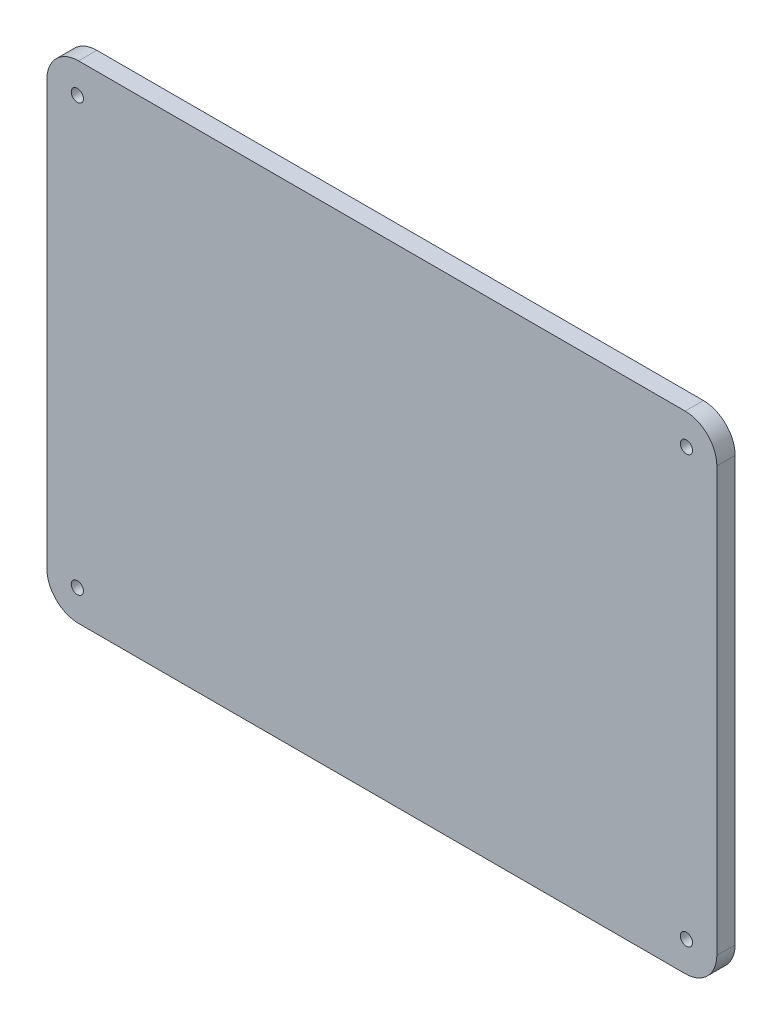
ISO-10303-21;
HEADER;
FILE_DESCRIPTION(('STEP AP214'),'2;1');
FILE_NAME('part.step','',(''),(''),'','','');
FILE_SCHEMA(('AUTOMOTIVE_DESIGN { 1 0 10303 214 1 1 1 1 }'));
ENDSEC;
DATA;
#1=APPLICATION_CONTEXT('core data for automotive mechanical design processes');
#2=APPLICATION_PROTOCOL_DEFINITION('international standard','automotive_design',2000,#1);
#3=PRODUCT_CONTEXT('',#1,'mechanical');
#4=PRODUCT('Part','Part','',(#3));
#5=PRODUCT_RELATED_PRODUCT_CATEGORY('part','',(#4));
#6=PRODUCT_DEFINITION_FORMATION('','',#4);
#7=PRODUCT_DEFINITION_CONTEXT('part definition',#1,'design');
#8=PRODUCT_DEFINITION('design','',#6,#7);
#9=PRODUCT_DEFINITION_SHAPE('','',#8);
#10=(LENGTH_UNIT() NAMED_UNIT(*) SI_UNIT(.MILLI.,.METRE.));
#11=(NAMED_UNIT(*) PLANE_ANGLE_UNIT() SI_UNIT($,.RADIAN.));
#12=(NAMED_UNIT(*) SI_UNIT($,.STERADIAN.) SOLID_ANGLE_UNIT());
#13=UNCERTAINTY_MEASURE_WITH_UNIT(LENGTH_MEASURE(1.E-05),#10,'distance_accuracy_value','');
#14=(GEOMETRIC_REPRESENTATION_CONTEXT(3) GLOBAL_UNCERTAINTY_ASSIGNED_CONTEXT((#13)) GLOBAL_UNIT_ASSIGNED_CONTEXT((#10,
#11,#12)) REPRESENTATION_CONTEXT('',''));
#15=CARTESIAN_POINT('',(0.,0.,0.));
#16=DIRECTION('',(0.,0.,1.));
#17=DIRECTION('',(1.,0.,0.));
#18=AXIS2_PLACEMENT_3D('',#15,#16,#17);
#19=CARTESIAN_POINT('',(49.8,34.8,3.));
#20=DIRECTION('',(0.,0.,-1.));
#21=DIRECTION('',(-1.,0.,0.));
#22=AXIS2_PLACEMENT_3D('',#19,#20,#21);
#23=CYLINDRICAL_SURFACE('',#22,5.2);
#24=CARTESIAN_POINT('',(49.8,34.8,0.));
#25=DIRECTION('',(0.,0.,1.));
#26=DIRECTION('',(-1.,0.,0.));
#27=AXIS2_PLACEMENT_3D('',#24,#25,#26);
#28=CIRCLE('',#27,5.2);
#29=CARTESIAN_POINT('',(55.,34.8,0.));
#30=VERTEX_POINT('',#29);
#31=CARTESIAN_POINT('',(49.8,40.,0.));
#32=VERTEX_POINT('',#31);
#33=EDGE_CURVE('E134',#30,#32,#28,.T.);
#34=ORIENTED_EDGE('',*,*,#33,.T.);
#35=DIRECTION('',(0.,0.,-1.));
#36=VECTOR('',#35,1.);
#37=CARTESIAN_POINT('',(49.8,40.,3.));
#38=LINE('',#37,#36);
#39=CARTESIAN_POINT('',(49.8,40.,3.));
#40=VERTEX_POINT('',#39);
#41=EDGE_CURVE('E11',#40,#32,#38,.T.);
#42=ORIENTED_EDGE('',*,*,#41,.F.);
#43=CARTESIAN_POINT('',(49.8,34.8,3.));
#44=DIRECTION('',(0.,0.,1.));
#45=DIRECTION('',(-1.,0.,0.));
#46=AXIS2_PLACEMENT_3D('',#43,#44,#45);
#47=CIRCLE('',#46,5.2);
#48=CARTESIAN_POINT('',(55.,34.8,3.));
#49=VERTEX_POINT('',#48);
#50=EDGE_CURVE('E149',#49,#40,#47,.T.);
#51=ORIENTED_EDGE('',*,*,#50,.F.);
#52=DIRECTION('',(0.,0.,-1.));
#53=VECTOR('',#52,1.);
#54=CARTESIAN_POINT('',(55.,34.8,3.));
#55=LINE('',#54,#53);
#56=EDGE_CURVE('E130',#49,#30,#55,.T.);
#57=ORIENTED_EDGE('',*,*,#56,.T.);
#58=EDGE_LOOP('',(#34,#42,#51,#57));
#59=FACE_BOUND('',#58,.T.);
#60=ADVANCED_FACE('F38',(#59),#23,.T.);
#61=CARTESIAN_POINT('',(-49.8,40.,3.));
#62=DIRECTION('',(0.,-1.,0.));
#63=DIRECTION('',(1.,0.,0.));
#64=AXIS2_PLACEMENT_3D('',#61,#62,#63);
#65=PLANE('',#64);
#66=DIRECTION('',(-1.,0.,0.));
#67=VECTOR('',#66,1.);
#68=CARTESIAN_POINT('',(-49.8,40.,0.));
#69=LINE('',#68,#67);
#70=CARTESIAN_POINT('',(-49.8,40.,0.));
#71=VERTEX_POINT('',#70);
#72=EDGE_CURVE('E137',#32,#71,#69,.T.);
#73=ORIENTED_EDGE('',*,*,#72,.T.);
#74=DIRECTION('',(0.,0.,-1.));
#75=VECTOR('',#74,1.);
#76=CARTESIAN_POINT('',(-49.8,40.,3.));
#77=LINE('',#76,#75);
#78=CARTESIAN_POINT('',(-49.8,40.,3.));
#79=VERTEX_POINT('',#78);
#80=EDGE_CURVE('E46',#79,#71,#77,.T.);
#81=ORIENTED_EDGE('',*,*,#80,.F.);
#82=DIRECTION('',(-1.,0.,0.));
#83=VECTOR('',#82,1.);
#84=CARTESIAN_POINT('',(-49.8,40.,3.));
#85=LINE('',#84,#83);
#86=EDGE_CURVE('E97',#40,#79,#85,.T.);
#87=ORIENTED_EDGE('',*,*,#86,.F.);
#88=ORIENTED_EDGE('',*,*,#41,.T.);
#89=EDGE_LOOP('',(#73,#81,#87,#88));
#90=FACE_BOUND('',#89,.T.);
#91=ADVANCED_FACE('F231',(#90),#65,.F.);
#92=CARTESIAN_POINT('',(-49.8,34.8,3.));
#93=DIRECTION('',(0.,0.,-1.));
#94=DIRECTION('',(-1.,0.,0.));
#95=AXIS2_PLACEMENT_3D('',#92,#93,#94);
#96=CYLINDRICAL_SURFACE('',#95,5.2);
#97=CARTESIAN_POINT('',(-49.8,34.8,0.));
#98=DIRECTION('',(0.,0.,1.));
#99=DIRECTION('',(1.,0.,0.));
#100=AXIS2_PLACEMENT_3D('',#97,#98,#99);
#101=CIRCLE('',#100,5.2);
#102=CARTESIAN_POINT('',(-55.,34.8,0.));
#103=VERTEX_POINT('',#102);
#104=EDGE_CURVE('E140',#71,#103,#101,.T.);
#105=ORIENTED_EDGE('',*,*,#104,.T.);
#106=DIRECTION('',(0.,0.,-1.));
#107=VECTOR('',#106,1.);
#108=CARTESIAN_POINT('',(-55.,34.8,3.));
#109=LINE('',#108,#107);
#110=CARTESIAN_POINT('',(-55.,34.8,3.));
#111=VERTEX_POINT('',#110);
#112=EDGE_CURVE('E156',#111,#103,#109,.T.);
#113=ORIENTED_EDGE('',*,*,#112,.F.);
#114=CARTESIAN_POINT('',(-49.8,34.8,3.));
#115=DIRECTION('',(0.,0.,1.));
#116=DIRECTION('',(1.,0.,0.));
#117=AXIS2_PLACEMENT_3D('',#114,#115,#116);
#118=CIRCLE('',#117,5.2);
#119=EDGE_CURVE('E164',#79,#111,#118,.T.);
#120=ORIENTED_EDGE('',*,*,#119,.F.);
#121=ORIENTED_EDGE('',*,*,#80,.T.);
#122=EDGE_LOOP('',(#105,#113,#120,#121));
#123=FACE_BOUND('',#122,.T.);
#124=ADVANCED_FACE('F162',(#123),#96,.T.);
#125=CARTESIAN_POINT('',(-55.,34.8,3.));
#126=DIRECTION('',(1.,0.,0.));
#127=DIRECTION('',(0.,1.,0.));
#128=AXIS2_PLACEMENT_3D('',#125,#126,#127);
#129=PLANE('',#128);
#130=DIRECTION('',(0.,-1.,0.));
#131=VECTOR('',#130,1.);
#132=CARTESIAN_POINT('',(-55.,34.8,0.));
#133=LINE('',#132,#131);
#134=CARTESIAN_POINT('',(-55.,-34.8,0.));
#135=VERTEX_POINT('',#134);
#136=EDGE_CURVE('E142',#103,#135,#133,.T.);
#137=ORIENTED_EDGE('',*,*,#136,.T.);
#138=DIRECTION('',(0.,0.,-1.));
#139=VECTOR('',#138,1.);
#140=CARTESIAN_POINT('',(-55.,-34.8,3.));
#141=LINE('',#140,#139);
#142=CARTESIAN_POINT('',(-55.,-34.8,3.));
#143=VERTEX_POINT('',#142);
#144=EDGE_CURVE('E153',#143,#135,#141,.T.);
#145=ORIENTED_EDGE('',*,*,#144,.F.);
#146=DIRECTION('',(0.,-1.,0.));
#147=VECTOR('',#146,1.);
#148=CARTESIAN_POINT('',(-55.,34.8,3.));
#149=LINE('',#148,#147);
#150=EDGE_CURVE('E176',#111,#143,#149,.T.);
#151=ORIENTED_EDGE('',*,*,#150,.F.);
#152=ORIENTED_EDGE('',*,*,#112,.T.);
#153=EDGE_LOOP('',(#137,#145,#151,#152));
#154=FACE_BOUND('',#153,.T.);
#155=ADVANCED_FACE('F172',(#154),#129,.F.);
#156=CARTESIAN_POINT('',(-49.8,-34.8,3.));
#157=DIRECTION('',(0.,0.,-1.));
#158=DIRECTION('',(-1.,0.,0.));
#159=AXIS2_PLACEMENT_3D('',#156,#157,#158);
#160=CYLINDRICAL_SURFACE('',#159,5.2);
#161=CARTESIAN_POINT('',(-49.8,-34.8,0.));
#162=DIRECTION('',(0.,0.,1.));
#163=DIRECTION('',(-1.,0.,0.));
#164=AXIS2_PLACEMENT_3D('',#161,#162,#163);
#165=CIRCLE('',#164,5.2);
#166=CARTESIAN_POINT('',(-49.8,-40.,0.));
#167=VERTEX_POINT('',#166);
#168=EDGE_CURVE('E144',#135,#167,#165,.T.);
#169=ORIENTED_EDGE('',*,*,#168,.T.);
#170=DIRECTION('',(0.,0.,-1.));
#171=VECTOR('',#170,1.);
#172=CARTESIAN_POINT('',(-49.8,-40.,3.));
#173=LINE('',#172,#171);
#174=CARTESIAN_POINT('',(-49.8,-40.,3.));
#175=VERTEX_POINT('',#174);
#176=EDGE_CURVE('E125',#175,#167,#173,.T.);
#177=ORIENTED_EDGE('',*,*,#176,.F.);
#178=CARTESIAN_POINT('',(-49.8,-34.8,3.));
#179=DIRECTION('',(0.,0.,1.));
#180=DIRECTION('',(-1.,0.,0.));
#181=AXIS2_PLACEMENT_3D('',#178,#179,#180);
#182=CIRCLE('',#181,5.2);
#183=EDGE_CURVE('E116',#143,#175,#182,.T.);
#184=ORIENTED_EDGE('',*,*,#183,.F.);
#185=ORIENTED_EDGE('',*,*,#144,.T.);
#186=EDGE_LOOP('',(#169,#177,#184,#185));
#187=FACE_BOUND('',#186,.T.);
#188=ADVANCED_FACE('F175',(#187),#160,.T.);
#189=CARTESIAN_POINT('',(-49.8,-40.,3.));
#190=DIRECTION('',(0.,1.,0.));
#191=DIRECTION('',(-1.,0.,0.));
#192=AXIS2_PLACEMENT_3D('',#189,#190,#191);
#193=PLANE('',#192);
#194=DIRECTION('',(1.,0.,0.));
#195=VECTOR('',#194,1.);
#196=CARTESIAN_POINT('',(-49.8,-40.,0.));
#197=LINE('',#196,#195);
#198=CARTESIAN_POINT('',(49.8,-40.,0.));
#199=VERTEX_POINT('',#198);
#200=EDGE_CURVE('E124',#167,#199,#197,.T.);
#201=ORIENTED_EDGE('',*,*,#200,.T.);
#202=DIRECTION('',(0.,0.,-1.));
#203=VECTOR('',#202,1.);
#204=CARTESIAN_POINT('',(49.8,-40.,3.));
#205=LINE('',#204,#203);
#206=CARTESIAN_POINT('',(49.8,-40.,3.));
#207=VERTEX_POINT('',#206);
#208=EDGE_CURVE('E121',#207,#199,#205,.T.);
#209=ORIENTED_EDGE('',*,*,#208,.F.);
#210=DIRECTION('',(1.,0.,0.));
#211=VECTOR('',#210,1.);
#212=CARTESIAN_POINT('',(-49.8,-40.,3.));
#213=LINE('',#212,#211);
#214=EDGE_CURVE('E110',#175,#207,#213,.T.);
#215=ORIENTED_EDGE('',*,*,#214,.F.);
#216=ORIENTED_EDGE('',*,*,#176,.T.);
#217=EDGE_LOOP('',(#201,#209,#215,#216));
#218=FACE_BOUND('',#217,.T.);
#219=ADVANCED_FACE('F122',(#218),#193,.F.);
#220=CARTESIAN_POINT('',(49.8,-34.8,3.));
#221=DIRECTION('',(0.,0.,-1.));
#222=DIRECTION('',(-1.,0.,0.));
#223=AXIS2_PLACEMENT_3D('',#220,#221,#222);
#224=CYLINDRICAL_SURFACE('',#223,5.2);
#225=CARTESIAN_POINT('',(49.8,-34.8,0.));
#226=DIRECTION('',(0.,0.,1.));
#227=DIRECTION('',(-1.,0.,0.));
#228=AXIS2_PLACEMENT_3D('',#225,#226,#227);
#229=CIRCLE('',#228,5.2);
#230=CARTESIAN_POINT('',(55.,-34.8,0.));
#231=VERTEX_POINT('',#230);
#232=EDGE_CURVE('E83',#199,#231,#229,.T.);
#233=ORIENTED_EDGE('',*,*,#232,.T.);
#234=DIRECTION('',(0.,0.,-1.));
#235=VECTOR('',#234,1.);
#236=CARTESIAN_POINT('',(55.,-34.8,3.));
#237=LINE('',#236,#235);
#238=CARTESIAN_POINT('',(55.,-34.8,3.));
#239=VERTEX_POINT('',#238);
#240=EDGE_CURVE('E126',#239,#231,#237,.T.);
#241=ORIENTED_EDGE('',*,*,#240,.F.);
#242=CARTESIAN_POINT('',(49.8,-34.8,3.));
#243=DIRECTION('',(0.,0.,1.));
#244=DIRECTION('',(-1.,0.,0.));
#245=AXIS2_PLACEMENT_3D('',#242,#243,#244);
#246=CIRCLE('',#245,5.2);
#247=EDGE_CURVE('E114',#207,#239,#246,.T.);
#248=ORIENTED_EDGE('',*,*,#247,.F.);
#249=ORIENTED_EDGE('',*,*,#208,.T.);
#250=EDGE_LOOP('',(#233,#241,#248,#249));
#251=FACE_BOUND('',#250,.T.);
#252=ADVANCED_FACE('F128',(#251),#224,.T.);
#253=CARTESIAN_POINT('',(55.,34.8,3.));
#254=DIRECTION('',(-1.,0.,0.));
#255=DIRECTION('',(0.,-1.,0.));
#256=AXIS2_PLACEMENT_3D('',#253,#254,#255);
#257=PLANE('',#256);
#258=DIRECTION('',(0.,1.,0.));
#259=VECTOR('',#258,1.);
#260=CARTESIAN_POINT('',(55.,34.8,0.));
#261=LINE('',#260,#259);
#262=EDGE_CURVE('E89',#231,#30,#261,.T.);
#263=ORIENTED_EDGE('',*,*,#262,.T.);
#264=ORIENTED_EDGE('',*,*,#56,.F.);
#265=DIRECTION('',(0.,1.,0.));
#266=VECTOR('',#265,1.);
#267=CARTESIAN_POINT('',(55.,34.8,3.));
#268=LINE('',#267,#266);
#269=EDGE_CURVE('E54',#239,#49,#268,.T.);
#270=ORIENTED_EDGE('',*,*,#269,.F.);
#271=ORIENTED_EDGE('',*,*,#240,.T.);
#272=EDGE_LOOP('',(#263,#264,#270,#271));
#273=FACE_BOUND('',#272,.T.);
#274=ADVANCED_FACE('F222',(#273),#257,.F.);
#275=CARTESIAN_POINT('',(49.8,34.8,3.));
#276=DIRECTION('',(0.,0.,-1.));
#277=DIRECTION('',(-1.,0.,0.));
#278=AXIS2_PLACEMENT_3D('',#275,#276,#277);
#279=PLANE('',#278);
#280=CARTESIAN_POINT('',(50.0040016653861,35.0000016013328,3.));
#281=DIRECTION('',(0.,0.,-1.));
#282=DIRECTION('',(-1.,0.,0.));
#283=AXIS2_PLACEMENT_3D('',#280,#281,#282);
#284=CIRCLE('',#283,0.999999999999998);
#285=CARTESIAN_POINT('',(49.0040016653861,35.0000016013328,3.));
#286=VERTEX_POINT('',#285);
#287=EDGE_CURVE('E138',#286,#286,#284,.T.);
#288=ORIENTED_EDGE('',*,*,#287,.T.);
#289=EDGE_LOOP('',(#288));
#290=FACE_BOUND('',#289,.T.);
#291=CARTESIAN_POINT('',(50.0040016653862,-35.0000016013328,3.));
#292=DIRECTION('',(0.,0.,-1.));
#293=DIRECTION('',(-1.,0.,0.));
#294=AXIS2_PLACEMENT_3D('',#291,#292,#293);
#295=CIRCLE('',#294,0.999999999999998);
#296=CARTESIAN_POINT('',(49.0040016653862,-35.0000016013328,3.));
#297=VERTEX_POINT('',#296);
#298=EDGE_CURVE('E184',#297,#297,#295,.T.);
#299=ORIENTED_EDGE('',*,*,#298,.T.);
#300=EDGE_LOOP('',(#299));
#301=FACE_BOUND('',#300,.T.);
#302=CARTESIAN_POINT('',(-50.0040016653862,-35.0000016013328,3.));
#303=DIRECTION('',(0.,0.,-1.));
#304=DIRECTION('',(-1.,0.,0.));
#305=AXIS2_PLACEMENT_3D('',#302,#303,#304);
#306=CIRCLE('',#305,0.999999999999998);
#307=CARTESIAN_POINT('',(-51.0040016653862,-35.0000016013328,3.));
#308=VERTEX_POINT('',#307);
#309=EDGE_CURVE('E187',#308,#308,#306,.T.);
#310=ORIENTED_EDGE('',*,*,#309,.T.);
#311=EDGE_LOOP('',(#310));
#312=FACE_BOUND('',#311,.T.);
#313=CARTESIAN_POINT('',(-50.0040016653862,35.0000016013328,3.));
#314=DIRECTION('',(0.,0.,-1.));
#315=DIRECTION('',(-1.,0.,0.));
#316=AXIS2_PLACEMENT_3D('',#313,#314,#315);
#317=CIRCLE('',#316,0.999999999999998);
#318=CARTESIAN_POINT('',(-51.0040016653862,35.0000016013328,3.));
#319=VERTEX_POINT('',#318);
#320=EDGE_CURVE('E190',#319,#319,#317,.T.);
#321=ORIENTED_EDGE('',*,*,#320,.T.);
#322=EDGE_LOOP('',(#321));
#323=FACE_BOUND('',#322,.T.);
#324=ORIENTED_EDGE('',*,*,#50,.T.);
#325=ORIENTED_EDGE('',*,*,#86,.T.);
#326=ORIENTED_EDGE('',*,*,#119,.T.);
#327=ORIENTED_EDGE('',*,*,#150,.T.);
#328=ORIENTED_EDGE('',*,*,#183,.T.);
#329=ORIENTED_EDGE('',*,*,#214,.T.);
#330=ORIENTED_EDGE('',*,*,#247,.T.);
#331=ORIENTED_EDGE('',*,*,#269,.T.);
#332=EDGE_LOOP('',(#324,#325,#326,#327,#328,#329,#330,#331));
#333=FACE_BOUND('',#332,.T.);
#334=ADVANCED_FACE('F112',(#290,#301,#312,#323,#333),#279,.F.);
#335=CARTESIAN_POINT('',(49.8,34.8,0.));
#336=DIRECTION('',(0.,0.,-1.));
#337=DIRECTION('',(-1.,0.,0.));
#338=AXIS2_PLACEMENT_3D('',#335,#336,#337);
#339=PLANE('',#338);
#340=CARTESIAN_POINT('',(50.0040016653861,35.0000016013328,0.));
#341=DIRECTION('',(0.,0.,-1.));
#342=DIRECTION('',(1.,0.,0.));
#343=AXIS2_PLACEMENT_3D('',#340,#341,#342);
#344=CIRCLE('',#343,0.999999999999998);
#345=CARTESIAN_POINT('',(51.0040016653861,35.0000016013328,0.));
#346=VERTEX_POINT('',#345);
#347=EDGE_CURVE('E197',#346,#346,#344,.T.);
#348=ORIENTED_EDGE('',*,*,#347,.F.);
#349=EDGE_LOOP('',(#348));
#350=FACE_BOUND('',#349,.T.);
#351=CARTESIAN_POINT('',(50.0040016653862,-35.0000016013328,0.));
#352=DIRECTION('',(0.,0.,-1.));
#353=DIRECTION('',(-1.,0.,0.));
#354=AXIS2_PLACEMENT_3D('',#351,#352,#353);
#355=CIRCLE('',#354,0.999999999999998);
#356=CARTESIAN_POINT('',(49.0040016653862,-35.0000016013328,0.));
#357=VERTEX_POINT('',#356);
#358=EDGE_CURVE('E200',#357,#357,#355,.T.);
#359=ORIENTED_EDGE('',*,*,#358,.F.);
#360=EDGE_LOOP('',(#359));
#361=FACE_BOUND('',#360,.T.);
#362=CARTESIAN_POINT('',(-50.0040016653862,-35.0000016013328,0.));
#363=DIRECTION('',(0.,0.,-1.));
#364=DIRECTION('',(1.,0.,0.));
#365=AXIS2_PLACEMENT_3D('',#362,#363,#364);
#366=CIRCLE('',#365,0.999999999999998);
#367=CARTESIAN_POINT('',(-49.0040016653862,-35.0000016013328,0.));
#368=VERTEX_POINT('',#367);
#369=EDGE_CURVE('E196',#368,#368,#366,.T.);
#370=ORIENTED_EDGE('',*,*,#369,.F.);
#371=EDGE_LOOP('',(#370));
#372=FACE_BOUND('',#371,.T.);
#373=CARTESIAN_POINT('',(-50.0040016653862,35.0000016013328,0.));
#374=DIRECTION('',(0.,0.,-1.));
#375=DIRECTION('',(-1.,0.,0.));
#376=AXIS2_PLACEMENT_3D('',#373,#374,#375);
#377=CIRCLE('',#376,0.999999999999998);
#378=CARTESIAN_POINT('',(-51.0040016653862,35.0000016013328,0.));
#379=VERTEX_POINT('',#378);
#380=EDGE_CURVE('E193',#379,#379,#377,.T.);
#381=ORIENTED_EDGE('',*,*,#380,.F.);
#382=EDGE_LOOP('',(#381));
#383=FACE_BOUND('',#382,.T.);
#384=ORIENTED_EDGE('',*,*,#33,.F.);
#385=ORIENTED_EDGE('',*,*,#262,.F.);
#386=ORIENTED_EDGE('',*,*,#232,.F.);
#387=ORIENTED_EDGE('',*,*,#200,.F.);
#388=ORIENTED_EDGE('',*,*,#168,.F.);
#389=ORIENTED_EDGE('',*,*,#136,.F.);
#390=ORIENTED_EDGE('',*,*,#104,.F.);
#391=ORIENTED_EDGE('',*,*,#72,.F.);
#392=EDGE_LOOP('',(#384,#385,#386,#387,#388,#389,#390,#391));
#393=FACE_BOUND('',#392,.T.);
#394=ADVANCED_FACE('F168',(#350,#361,#372,#383,#393),#339,.T.);
#395=CARTESIAN_POINT('',(-50.0040016653862,35.0000016013328,10.));
#396=DIRECTION('',(0.,0.,-1.));
#397=DIRECTION('',(-1.,0.,0.));
#398=AXIS2_PLACEMENT_3D('',#395,#396,#397);
#399=CYLINDRICAL_SURFACE('',#398,0.999999999999998);
#400=ORIENTED_EDGE('',*,*,#380,.T.);
#401=EDGE_LOOP('',(#400));
#402=FACE_BOUND('',#401,.T.);
#403=ORIENTED_EDGE('',*,*,#320,.F.);
#404=EDGE_LOOP('',(#403));
#405=FACE_BOUND('',#404,.T.);
#406=ADVANCED_FACE('F211',(#402,#405),#399,.F.);
#407=CARTESIAN_POINT('',(-50.0040016653862,-35.0000016013328,10.));
#408=DIRECTION('',(0.,0.,-1.));
#409=DIRECTION('',(-1.,0.,0.));
#410=AXIS2_PLACEMENT_3D('',#407,#408,#409);
#411=CYLINDRICAL_SURFACE('',#410,0.999999999999998);
#412=ORIENTED_EDGE('',*,*,#369,.T.);
#413=EDGE_LOOP('',(#412));
#414=FACE_BOUND('',#413,.T.);
#415=ORIENTED_EDGE('',*,*,#309,.F.);
#416=EDGE_LOOP('',(#415));
#417=FACE_BOUND('',#416,.T.);
#418=ADVANCED_FACE('F206',(#414,#417),#411,.F.);
#419=CARTESIAN_POINT('',(50.0040016653862,-35.0000016013328,10.));
#420=DIRECTION('',(0.,0.,-1.));
#421=DIRECTION('',(-1.,0.,0.));
#422=AXIS2_PLACEMENT_3D('',#419,#420,#421);
#423=CYLINDRICAL_SURFACE('',#422,0.999999999999998);
#424=ORIENTED_EDGE('',*,*,#358,.T.);
#425=EDGE_LOOP('',(#424));
#426=FACE_BOUND('',#425,.T.);
#427=ORIENTED_EDGE('',*,*,#298,.F.);
#428=EDGE_LOOP('',(#427));
#429=FACE_BOUND('',#428,.T.);
#430=ADVANCED_FACE('F285',(#426,#429),#423,.F.);
#431=CARTESIAN_POINT('',(50.0040016653861,35.0000016013328,10.));
#432=DIRECTION('',(0.,0.,-1.));
#433=DIRECTION('',(-1.,0.,0.));
#434=AXIS2_PLACEMENT_3D('',#431,#432,#433);
#435=CYLINDRICAL_SURFACE('',#434,0.999999999999998);
#436=ORIENTED_EDGE('',*,*,#347,.T.);
#437=EDGE_LOOP('',(#436));
#438=FACE_BOUND('',#437,.T.);
#439=ORIENTED_EDGE('',*,*,#287,.F.);
#440=EDGE_LOOP('',(#439));
#441=FACE_BOUND('',#440,.T.);
#442=ADVANCED_FACE('F294',(#438,#441),#435,.F.);
#443=CLOSED_SHELL('',(#60,#91,#124,#155,#188,#219,#252,#274,#334,#394,#406,#418,#430,#442));
#444=MANIFOLD_SOLID_BREP('B2',#443);
#445=ADVANCED_BREP_SHAPE_REPRESENTATION('',(#18,#444),#14);
#446=SHAPE_DEFINITION_REPRESENTATION(#9,#445);
ENDSEC;
END-ISO-10303-21;
